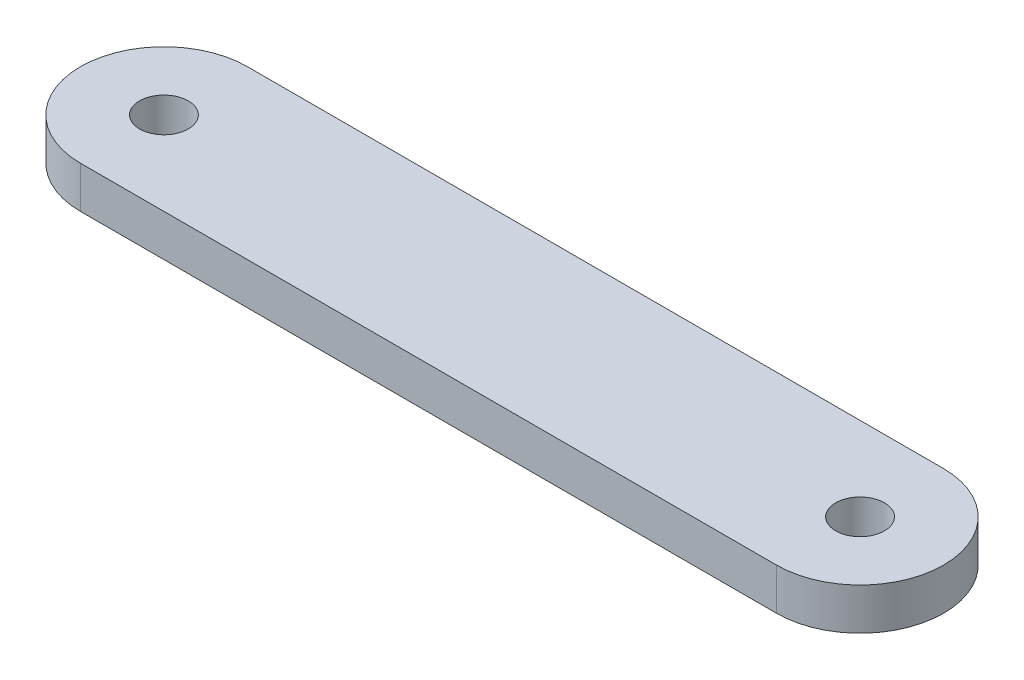
ISO-10303-21;
HEADER;
FILE_DESCRIPTION(('STEP AP214'),'2;1');
FILE_NAME('part.step','',(''),(''),'','','');
FILE_SCHEMA(('AUTOMOTIVE_DESIGN { 1 0 10303 214 1 1 1 1 }'));
ENDSEC;
DATA;
#1=APPLICATION_CONTEXT('core data for automotive mechanical design processes');
#2=APPLICATION_PROTOCOL_DEFINITION('international standard','automotive_design',2000,#1);
#3=PRODUCT_CONTEXT('',#1,'mechanical');
#4=PRODUCT('Part','Part','',(#3));
#5=PRODUCT_RELATED_PRODUCT_CATEGORY('part','',(#4));
#6=PRODUCT_DEFINITION_FORMATION('','',#4);
#7=PRODUCT_DEFINITION_CONTEXT('part definition',#1,'design');
#8=PRODUCT_DEFINITION('design','',#6,#7);
#9=PRODUCT_DEFINITION_SHAPE('','',#8);
#10=(LENGTH_UNIT() NAMED_UNIT(*) SI_UNIT(.MILLI.,.METRE.));
#11=(NAMED_UNIT(*) PLANE_ANGLE_UNIT() SI_UNIT($,.RADIAN.));
#12=(NAMED_UNIT(*) SI_UNIT($,.STERADIAN.) SOLID_ANGLE_UNIT());
#13=UNCERTAINTY_MEASURE_WITH_UNIT(LENGTH_MEASURE(1.E-05),#10,'distance_accuracy_value','');
#14=(GEOMETRIC_REPRESENTATION_CONTEXT(3) GLOBAL_UNCERTAINTY_ASSIGNED_CONTEXT((#13)) GLOBAL_UNIT_ASSIGNED_CONTEXT((#10,
#11,#12)) REPRESENTATION_CONTEXT('',''));
#15=CARTESIAN_POINT('',(0.,0.,0.));
#16=DIRECTION('',(0.,0.,1.));
#17=DIRECTION('',(1.,0.,0.));
#18=AXIS2_PLACEMENT_3D('',#15,#16,#17);
#19=CARTESIAN_POINT('',(0.,3.,0.));
#20=DIRECTION('',(0.,1.,0.));
#21=DIRECTION('',(0.,0.,1.));
#22=AXIS2_PLACEMENT_3D('',#19,#20,#21);
#23=PLANE('',#22);
#24=CARTESIAN_POINT('',(0.,3.,0.));
#25=DIRECTION('',(0.,1.,0.));
#26=DIRECTION('',(0.,0.,1.));
#27=AXIS2_PLACEMENT_3D('',#24,#25,#26);
#28=CIRCLE('',#27,1.75);
#29=CARTESIAN_POINT('',(0.,3.,1.75));
#30=VERTEX_POINT('',#29);
#31=EDGE_CURVE('E100',#30,#30,#28,.T.);
#32=ORIENTED_EDGE('',*,*,#31,.F.);
#33=EDGE_LOOP('',(#32));
#34=FACE_BOUND('',#33,.T.);
#35=CARTESIAN_POINT('',(0.,3.,0.));
#36=DIRECTION('',(0.,1.,0.));
#37=DIRECTION('',(0.,0.,1.));
#38=AXIS2_PLACEMENT_3D('',#35,#36,#37);
#39=CIRCLE('',#38,6.);
#40=CARTESIAN_POINT('',(0.,3.,-6.));
#41=VERTEX_POINT('',#40);
#42=CARTESIAN_POINT('',(0.,3.,6.));
#43=VERTEX_POINT('',#42);
#44=EDGE_CURVE('E85',#41,#43,#39,.T.);
#45=ORIENTED_EDGE('',*,*,#44,.T.);
#46=DIRECTION('',(1.,0.,0.));
#47=VECTOR('',#46,1.);
#48=CARTESIAN_POINT('',(0.,3.,6.));
#49=LINE('',#48,#47);
#50=CARTESIAN_POINT('',(50.,3.,6.));
#51=VERTEX_POINT('',#50);
#52=EDGE_CURVE('E80',#43,#51,#49,.T.);
#53=ORIENTED_EDGE('',*,*,#52,.T.);
#54=CARTESIAN_POINT('',(50.,3.,0.));
#55=DIRECTION('',(0.,1.,0.));
#56=DIRECTION('',(0.,0.,1.));
#57=AXIS2_PLACEMENT_3D('',#54,#55,#56);
#58=CIRCLE('',#57,6.);
#59=CARTESIAN_POINT('',(50.,3.,-6.));
#60=VERTEX_POINT('',#59);
#61=EDGE_CURVE('E83',#51,#60,#58,.T.);
#62=ORIENTED_EDGE('',*,*,#61,.T.);
#63=DIRECTION('',(-1.,0.,0.));
#64=VECTOR('',#63,1.);
#65=CARTESIAN_POINT('',(0.,3.,-6.));
#66=LINE('',#65,#64);
#67=EDGE_CURVE('E50',#60,#41,#66,.T.);
#68=ORIENTED_EDGE('',*,*,#67,.T.);
#69=EDGE_LOOP('',(#45,#53,#62,#68));
#70=FACE_BOUND('',#69,.T.);
#71=CARTESIAN_POINT('',(50.,3.,0.));
#72=DIRECTION('',(0.,1.,0.));
#73=DIRECTION('',(0.,0.,1.));
#74=AXIS2_PLACEMENT_3D('',#71,#72,#73);
#75=CIRCLE('',#74,1.75);
#76=CARTESIAN_POINT('',(50.,3.,1.75));
#77=VERTEX_POINT('',#76);
#78=EDGE_CURVE('E115',#77,#77,#75,.T.);
#79=ORIENTED_EDGE('',*,*,#78,.F.);
#80=EDGE_LOOP('',(#79));
#81=FACE_BOUND('',#80,.T.);
#82=ADVANCED_FACE('F33',(#34,#70,#81),#23,.T.);
#83=CARTESIAN_POINT('',(0.,0.,0.));
#84=DIRECTION('',(0.,1.,0.));
#85=DIRECTION('',(0.,0.,1.));
#86=AXIS2_PLACEMENT_3D('',#83,#84,#85);
#87=PLANE('',#86);
#88=CARTESIAN_POINT('',(0.,0.,0.));
#89=DIRECTION('',(0.,1.,0.));
#90=DIRECTION('',(0.,0.,1.));
#91=AXIS2_PLACEMENT_3D('',#88,#89,#90);
#92=CIRCLE('',#91,6.);
#93=CARTESIAN_POINT('',(0.,0.,-6.));
#94=VERTEX_POINT('',#93);
#95=CARTESIAN_POINT('',(0.,0.,6.));
#96=VERTEX_POINT('',#95);
#97=EDGE_CURVE('E97',#94,#96,#92,.T.);
#98=ORIENTED_EDGE('',*,*,#97,.F.);
#99=DIRECTION('',(-1.,0.,0.));
#100=VECTOR('',#99,1.);
#101=CARTESIAN_POINT('',(0.,0.,-6.));
#102=LINE('',#101,#100);
#103=CARTESIAN_POINT('',(50.,0.,-6.));
#104=VERTEX_POINT('',#103);
#105=EDGE_CURVE('E73',#104,#94,#102,.T.);
#106=ORIENTED_EDGE('',*,*,#105,.F.);
#107=CARTESIAN_POINT('',(50.,0.,0.));
#108=DIRECTION('',(0.,1.,0.));
#109=DIRECTION('',(0.,0.,1.));
#110=AXIS2_PLACEMENT_3D('',#107,#108,#109);
#111=CIRCLE('',#110,6.);
#112=CARTESIAN_POINT('',(50.,0.,6.));
#113=VERTEX_POINT('',#112);
#114=EDGE_CURVE('E67',#113,#104,#111,.T.);
#115=ORIENTED_EDGE('',*,*,#114,.F.);
#116=DIRECTION('',(1.,0.,0.));
#117=VECTOR('',#116,1.);
#118=CARTESIAN_POINT('',(0.,0.,6.));
#119=LINE('',#118,#117);
#120=EDGE_CURVE('E89',#96,#113,#119,.T.);
#121=ORIENTED_EDGE('',*,*,#120,.F.);
#122=EDGE_LOOP('',(#98,#106,#115,#121));
#123=FACE_BOUND('',#122,.T.);
#124=CARTESIAN_POINT('',(0.,0.,0.));
#125=DIRECTION('',(0.,1.,0.));
#126=DIRECTION('',(0.,0.,1.));
#127=AXIS2_PLACEMENT_3D('',#124,#125,#126);
#128=CIRCLE('',#127,1.75);
#129=CARTESIAN_POINT('',(0.,0.,1.75));
#130=VERTEX_POINT('',#129);
#131=EDGE_CURVE('E112',#130,#130,#128,.T.);
#132=ORIENTED_EDGE('',*,*,#131,.T.);
#133=EDGE_LOOP('',(#132));
#134=FACE_BOUND('',#133,.T.);
#135=CARTESIAN_POINT('',(50.,0.,0.));
#136=DIRECTION('',(0.,1.,0.));
#137=DIRECTION('',(0.,0.,1.));
#138=AXIS2_PLACEMENT_3D('',#135,#136,#137);
#139=CIRCLE('',#138,1.75);
#140=CARTESIAN_POINT('',(50.,0.,1.75));
#141=VERTEX_POINT('',#140);
#142=EDGE_CURVE('E118',#141,#141,#139,.T.);
#143=ORIENTED_EDGE('',*,*,#142,.T.);
#144=EDGE_LOOP('',(#143));
#145=FACE_BOUND('',#144,.T.);
#146=ADVANCED_FACE('F108',(#123,#134,#145),#87,.F.);
#147=CARTESIAN_POINT('',(0.,3.,0.));
#148=DIRECTION('',(0.,-1.,0.));
#149=DIRECTION('',(0.,0.,-1.));
#150=AXIS2_PLACEMENT_3D('',#147,#148,#149);
#151=CYLINDRICAL_SURFACE('',#150,6.);
#152=ORIENTED_EDGE('',*,*,#97,.T.);
#153=DIRECTION('',(0.,-1.,0.));
#154=VECTOR('',#153,1.);
#155=CARTESIAN_POINT('',(0.,3.,6.));
#156=LINE('',#155,#154);
#157=EDGE_CURVE('E11',#43,#96,#156,.T.);
#158=ORIENTED_EDGE('',*,*,#157,.F.);
#159=ORIENTED_EDGE('',*,*,#44,.F.);
#160=DIRECTION('',(0.,-1.,0.));
#161=VECTOR('',#160,1.);
#162=CARTESIAN_POINT('',(0.,3.,-6.));
#163=LINE('',#162,#161);
#164=EDGE_CURVE('E93',#41,#94,#163,.T.);
#165=ORIENTED_EDGE('',*,*,#164,.T.);
#166=EDGE_LOOP('',(#152,#158,#159,#165));
#167=FACE_BOUND('',#166,.T.);
#168=ADVANCED_FACE('F35',(#167),#151,.T.);
#169=CARTESIAN_POINT('',(0.,3.,6.));
#170=DIRECTION('',(0.,0.,-1.));
#171=DIRECTION('',(-1.,0.,0.));
#172=AXIS2_PLACEMENT_3D('',#169,#170,#171);
#173=PLANE('',#172);
#174=ORIENTED_EDGE('',*,*,#120,.T.);
#175=DIRECTION('',(0.,-1.,0.));
#176=VECTOR('',#175,1.);
#177=CARTESIAN_POINT('',(50.,3.,6.));
#178=LINE('',#177,#176);
#179=EDGE_CURVE('E42',#51,#113,#178,.T.);
#180=ORIENTED_EDGE('',*,*,#179,.F.);
#181=ORIENTED_EDGE('',*,*,#52,.F.);
#182=ORIENTED_EDGE('',*,*,#157,.T.);
#183=EDGE_LOOP('',(#174,#180,#181,#182));
#184=FACE_BOUND('',#183,.T.);
#185=ADVANCED_FACE('F88',(#184),#173,.F.);
#186=CARTESIAN_POINT('',(50.,3.,0.));
#187=DIRECTION('',(0.,-1.,0.));
#188=DIRECTION('',(0.,0.,-1.));
#189=AXIS2_PLACEMENT_3D('',#186,#187,#188);
#190=CYLINDRICAL_SURFACE('',#189,6.);
#191=ORIENTED_EDGE('',*,*,#114,.T.);
#192=DIRECTION('',(0.,-1.,0.));
#193=VECTOR('',#192,1.);
#194=CARTESIAN_POINT('',(50.,3.,-6.));
#195=LINE('',#194,#193);
#196=EDGE_CURVE('E90',#60,#104,#195,.T.);
#197=ORIENTED_EDGE('',*,*,#196,.F.);
#198=ORIENTED_EDGE('',*,*,#61,.F.);
#199=ORIENTED_EDGE('',*,*,#179,.T.);
#200=EDGE_LOOP('',(#191,#197,#198,#199));
#201=FACE_BOUND('',#200,.T.);
#202=ADVANCED_FACE('F91',(#201),#190,.T.);
#203=CARTESIAN_POINT('',(0.,3.,-6.));
#204=DIRECTION('',(0.,0.,1.));
#205=DIRECTION('',(1.,0.,0.));
#206=AXIS2_PLACEMENT_3D('',#203,#204,#205);
#207=PLANE('',#206);
#208=ORIENTED_EDGE('',*,*,#105,.T.);
#209=ORIENTED_EDGE('',*,*,#164,.F.);
#210=ORIENTED_EDGE('',*,*,#67,.F.);
#211=ORIENTED_EDGE('',*,*,#196,.T.);
#212=EDGE_LOOP('',(#208,#209,#210,#211));
#213=FACE_BOUND('',#212,.T.);
#214=ADVANCED_FACE('F105',(#213),#207,.F.);
#215=CARTESIAN_POINT('',(0.,3.,0.));
#216=DIRECTION('',(0.,-1.,0.));
#217=DIRECTION('',(0.,0.,-1.));
#218=AXIS2_PLACEMENT_3D('',#215,#216,#217);
#219=CYLINDRICAL_SURFACE('',#218,1.75);
#220=ORIENTED_EDGE('',*,*,#31,.T.);
#221=EDGE_LOOP('',(#220));
#222=FACE_BOUND('',#221,.T.);
#223=ORIENTED_EDGE('',*,*,#131,.F.);
#224=EDGE_LOOP('',(#223));
#225=FACE_BOUND('',#224,.T.);
#226=ADVANCED_FACE('F135',(#222,#225),#219,.F.);
#227=CARTESIAN_POINT('',(50.,3.,0.));
#228=DIRECTION('',(0.,-1.,0.));
#229=DIRECTION('',(0.,0.,-1.));
#230=AXIS2_PLACEMENT_3D('',#227,#228,#229);
#231=CYLINDRICAL_SURFACE('',#230,1.75);
#232=ORIENTED_EDGE('',*,*,#78,.T.);
#233=EDGE_LOOP('',(#232));
#234=FACE_BOUND('',#233,.T.);
#235=ORIENTED_EDGE('',*,*,#142,.F.);
#236=EDGE_LOOP('',(#235));
#237=FACE_BOUND('',#236,.T.);
#238=ADVANCED_FACE('F124',(#234,#237),#231,.F.);
#239=CLOSED_SHELL('',(#82,#146,#168,#185,#202,#214,#226,#238));
#240=MANIFOLD_SOLID_BREP('B2',#239);
#241=ADVANCED_BREP_SHAPE_REPRESENTATION('',(#18,#240),#14);
#242=SHAPE_DEFINITION_REPRESENTATION(#9,#241);
ENDSEC;
END-ISO-10303-21;
